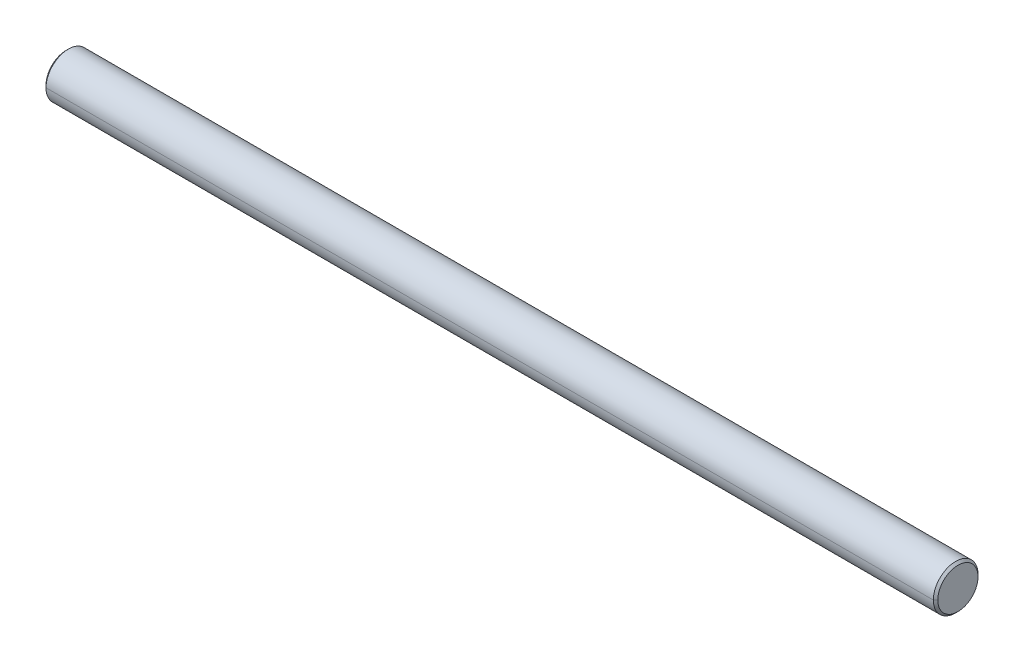
ISO-10303-21;
HEADER;
FILE_DESCRIPTION(('STEP AP214'),'2;1');
FILE_NAME('part.step','',(''),(''),'','','');
FILE_SCHEMA(('AUTOMOTIVE_DESIGN { 1 0 10303 214 1 1 1 1 }'));
ENDSEC;
DATA;
#1=APPLICATION_CONTEXT('core data for automotive mechanical design processes');
#2=APPLICATION_PROTOCOL_DEFINITION('international standard','automotive_design',2000,#1);
#3=PRODUCT_CONTEXT('',#1,'mechanical');
#4=PRODUCT('Part','Part','',(#3));
#5=PRODUCT_RELATED_PRODUCT_CATEGORY('part','',(#4));
#6=PRODUCT_DEFINITION_FORMATION('','',#4);
#7=PRODUCT_DEFINITION_CONTEXT('part definition',#1,'design');
#8=PRODUCT_DEFINITION('design','',#6,#7);
#9=PRODUCT_DEFINITION_SHAPE('','',#8);
#10=(LENGTH_UNIT() NAMED_UNIT(*) SI_UNIT(.MILLI.,.METRE.));
#11=(NAMED_UNIT(*) PLANE_ANGLE_UNIT() SI_UNIT($,.RADIAN.));
#12=(NAMED_UNIT(*) SI_UNIT($,.STERADIAN.) SOLID_ANGLE_UNIT());
#13=UNCERTAINTY_MEASURE_WITH_UNIT(LENGTH_MEASURE(1.E-05),#10,'distance_accuracy_value','');
#14=(GEOMETRIC_REPRESENTATION_CONTEXT(3) GLOBAL_UNCERTAINTY_ASSIGNED_CONTEXT((#13)) GLOBAL_UNIT_ASSIGNED_CONTEXT((#10,
#11,#12)) REPRESENTATION_CONTEXT('',''));
#15=CARTESIAN_POINT('',(0.,0.,0.));
#16=DIRECTION('',(0.,0.,1.));
#17=DIRECTION('',(1.,0.,0.));
#18=AXIS2_PLACEMENT_3D('',#15,#16,#17);
#19=CARTESIAN_POINT('',(489.,0.,0.));
#20=DIRECTION('',(1.,0.,0.));
#21=DIRECTION('',(0.,1.,0.));
#22=AXIS2_PLACEMENT_3D('',#19,#20,#21);
#23=CYLINDRICAL_SURFACE('',#22,12.5);
#24=DIRECTION('',(1.,0.,0.));
#25=VECTOR('',#24,1.);
#26=CARTESIAN_POINT('',(1.25,0.,12.5));
#27=LINE('',#26,#25);
#28=CARTESIAN_POINT('',(1.25,0.,12.5));
#29=VERTEX_POINT('',#28);
#30=CARTESIAN_POINT('',(497.75,0.,12.5));
#31=VERTEX_POINT('',#30);
#32=EDGE_CURVE('E11',#29,#31,#27,.T.);
#33=ORIENTED_EDGE('',*,*,#32,.F.);
#34=CARTESIAN_POINT('',(1.25,0.,0.));
#35=DIRECTION('',(1.,0.,0.));
#36=DIRECTION('',(0.,0.,-1.));
#37=AXIS2_PLACEMENT_3D('',#34,#35,#36);
#38=CIRCLE('',#37,12.5);
#39=CARTESIAN_POINT('',(1.25,0.,-12.5));
#40=VERTEX_POINT('',#39);
#41=EDGE_CURVE('E25',#29,#40,#38,.T.);
#42=ORIENTED_EDGE('',*,*,#41,.T.);
#43=DIRECTION('',(1.,0.,0.));
#44=VECTOR('',#43,1.);
#45=CARTESIAN_POINT('',(1.25,0.,-12.5));
#46=LINE('',#45,#44);
#47=CARTESIAN_POINT('',(497.75,0.,-12.5));
#48=VERTEX_POINT('',#47);
#49=EDGE_CURVE('E108',#40,#48,#46,.T.);
#50=ORIENTED_EDGE('',*,*,#49,.T.);
#51=CARTESIAN_POINT('',(497.75,0.,0.));
#52=DIRECTION('',(1.,0.,0.));
#53=DIRECTION('',(0.,0.,-1.));
#54=AXIS2_PLACEMENT_3D('',#51,#52,#53);
#55=CIRCLE('',#54,12.5);
#56=EDGE_CURVE('E103',#31,#48,#55,.T.);
#57=ORIENTED_EDGE('',*,*,#56,.F.);
#58=EDGE_LOOP('',(#33,#42,#50,#57));
#59=FACE_BOUND('',#58,.T.);
#60=ADVANCED_FACE('F17',(#59),#23,.T.);
#61=CARTESIAN_POINT('',(497.75,0.,0.));
#62=DIRECTION('',(-1.,0.,0.));
#63=DIRECTION('',(0.,1.,0.));
#64=AXIS2_PLACEMENT_3D('',#61,#62,#63);
#65=CONICAL_SURFACE('',#64,12.5,0.785398163397459);
#66=DIRECTION('',(-0.707106781186543,0.,-0.707106781186552));
#67=VECTOR('',#66,1.);
#68=CARTESIAN_POINT('',(499.,0.,-11.25));
#69=LINE('',#68,#67);
#70=CARTESIAN_POINT('',(499.,0.,-11.25));
#71=VERTEX_POINT('',#70);
#72=EDGE_CURVE('E98',#71,#48,#69,.T.);
#73=ORIENTED_EDGE('',*,*,#72,.F.);
#74=CARTESIAN_POINT('',(499.,0.,0.));
#75=DIRECTION('',(1.,0.,0.));
#76=DIRECTION('',(0.,0.,-1.));
#77=AXIS2_PLACEMENT_3D('',#74,#75,#76);
#78=CIRCLE('',#77,11.25);
#79=CARTESIAN_POINT('',(499.,0.,11.25));
#80=VERTEX_POINT('',#79);
#81=EDGE_CURVE('E93',#80,#71,#78,.T.);
#82=ORIENTED_EDGE('',*,*,#81,.F.);
#83=DIRECTION('',(-0.707106781186543,0.,0.707106781186552));
#84=VECTOR('',#83,1.);
#85=CARTESIAN_POINT('',(499.,0.,11.25));
#86=LINE('',#85,#84);
#87=EDGE_CURVE('E88',#80,#31,#86,.T.);
#88=ORIENTED_EDGE('',*,*,#87,.T.);
#89=ORIENTED_EDGE('',*,*,#56,.T.);
#90=EDGE_LOOP('',(#73,#82,#88,#89));
#91=FACE_BOUND('',#90,.T.);
#92=ADVANCED_FACE('F125',(#91),#65,.T.);
#93=CARTESIAN_POINT('',(497.75,0.,0.));
#94=DIRECTION('',(-1.,0.,0.));
#95=DIRECTION('',(0.,-1.,0.));
#96=AXIS2_PLACEMENT_3D('',#93,#94,#95);
#97=CONICAL_SURFACE('',#96,12.5,0.785398163397459);
#98=ORIENTED_EDGE('',*,*,#72,.T.);
#99=CARTESIAN_POINT('',(497.75,0.,0.));
#100=DIRECTION('',(1.,0.,0.));
#101=DIRECTION('',(0.,0.,-1.));
#102=AXIS2_PLACEMENT_3D('',#99,#100,#101);
#103=CIRCLE('',#102,12.5);
#104=EDGE_CURVE('E83',#48,#31,#103,.T.);
#105=ORIENTED_EDGE('',*,*,#104,.T.);
#106=ORIENTED_EDGE('',*,*,#87,.F.);
#107=CARTESIAN_POINT('',(499.,0.,0.));
#108=DIRECTION('',(1.,0.,0.));
#109=DIRECTION('',(0.,0.,-1.));
#110=AXIS2_PLACEMENT_3D('',#107,#108,#109);
#111=CIRCLE('',#110,11.25);
#112=EDGE_CURVE('E71',#71,#80,#111,.T.);
#113=ORIENTED_EDGE('',*,*,#112,.F.);
#114=EDGE_LOOP('',(#98,#105,#106,#113));
#115=FACE_BOUND('',#114,.T.);
#116=ADVANCED_FACE('F123',(#115),#97,.T.);
#117=CARTESIAN_POINT('',(499.,0.,-11.25));
#118=DIRECTION('',(-1.,0.,0.));
#119=DIRECTION('',(0.,0.,1.));
#120=AXIS2_PLACEMENT_3D('',#117,#118,#119);
#121=PLANE('',#120);
#122=ORIENTED_EDGE('',*,*,#112,.T.);
#123=ORIENTED_EDGE('',*,*,#81,.T.);
#124=EDGE_LOOP('',(#122,#123));
#125=FACE_BOUND('',#124,.T.);
#126=ADVANCED_FACE('F127',(#125),#121,.F.);
#127=CARTESIAN_POINT('',(489.,0.,0.));
#128=DIRECTION('',(1.,0.,0.));
#129=DIRECTION('',(0.,-1.,-2.35728675822409E-12));
#130=AXIS2_PLACEMENT_3D('',#127,#128,#129);
#131=CYLINDRICAL_SURFACE('',#130,12.5);
#132=ORIENTED_EDGE('',*,*,#32,.T.);
#133=ORIENTED_EDGE('',*,*,#104,.F.);
#134=ORIENTED_EDGE('',*,*,#49,.F.);
#135=CARTESIAN_POINT('',(1.25,0.,0.));
#136=DIRECTION('',(1.,0.,0.));
#137=DIRECTION('',(0.,0.,-1.));
#138=AXIS2_PLACEMENT_3D('',#135,#136,#137);
#139=CIRCLE('',#138,12.5);
#140=EDGE_CURVE('E69',#40,#29,#139,.T.);
#141=ORIENTED_EDGE('',*,*,#140,.T.);
#142=EDGE_LOOP('',(#132,#133,#134,#141));
#143=FACE_BOUND('',#142,.T.);
#144=ADVANCED_FACE('F119',(#143),#131,.T.);
#145=CARTESIAN_POINT('',(0.,0.,0.));
#146=DIRECTION('',(1.,0.,0.));
#147=DIRECTION('',(0.,-1.,0.));
#148=AXIS2_PLACEMENT_3D('',#145,#146,#147);
#149=CONICAL_SURFACE('',#148,11.25,0.78539816339745);
#150=DIRECTION('',(0.707106781186547,0.,0.707106781186548));
#151=VECTOR('',#150,1.);
#152=CARTESIAN_POINT('',(0.,0.,11.25));
#153=LINE('',#152,#151);
#154=CARTESIAN_POINT('',(0.,0.,11.25));
#155=VERTEX_POINT('',#154);
#156=EDGE_CURVE('E59',#155,#29,#153,.T.);
#157=ORIENTED_EDGE('',*,*,#156,.T.);
#158=ORIENTED_EDGE('',*,*,#140,.F.);
#159=DIRECTION('',(0.707106781186547,0.,-0.707106781186548));
#160=VECTOR('',#159,1.);
#161=CARTESIAN_POINT('',(0.,0.,-11.25));
#162=LINE('',#161,#160);
#163=CARTESIAN_POINT('',(0.,0.,-11.25));
#164=VERTEX_POINT('',#163);
#165=EDGE_CURVE('E60',#164,#40,#162,.T.);
#166=ORIENTED_EDGE('',*,*,#165,.F.);
#167=CARTESIAN_POINT('',(0.,0.,0.));
#168=DIRECTION('',(1.,0.,0.));
#169=DIRECTION('',(0.,0.,-1.));
#170=AXIS2_PLACEMENT_3D('',#167,#168,#169);
#171=CIRCLE('',#170,11.25);
#172=EDGE_CURVE('E54',#164,#155,#171,.T.);
#173=ORIENTED_EDGE('',*,*,#172,.T.);
#174=EDGE_LOOP('',(#157,#158,#166,#173));
#175=FACE_BOUND('',#174,.T.);
#176=ADVANCED_FACE('F56',(#175),#149,.T.);
#177=CARTESIAN_POINT('',(0.,0.,0.));
#178=DIRECTION('',(1.,0.,0.));
#179=DIRECTION('',(0.,0.,-1.));
#180=AXIS2_PLACEMENT_3D('',#177,#178,#179);
#181=PLANE('',#180);
#182=CARTESIAN_POINT('',(0.,0.,0.));
#183=DIRECTION('',(1.,0.,0.));
#184=DIRECTION('',(0.,0.,-1.));
#185=AXIS2_PLACEMENT_3D('',#182,#183,#184);
#186=CIRCLE('',#185,11.25);
#187=EDGE_CURVE('E63',#155,#164,#186,.T.);
#188=ORIENTED_EDGE('',*,*,#187,.F.);
#189=ORIENTED_EDGE('',*,*,#172,.F.);
#190=EDGE_LOOP('',(#188,#189));
#191=FACE_BOUND('',#190,.T.);
#192=ADVANCED_FACE('F65',(#191),#181,.F.);
#193=CARTESIAN_POINT('',(0.,0.,0.));
#194=DIRECTION('',(1.,0.,0.));
#195=DIRECTION('',(0.,1.,0.));
#196=AXIS2_PLACEMENT_3D('',#193,#194,#195);
#197=CONICAL_SURFACE('',#196,11.25,0.78539816339745);
#198=ORIENTED_EDGE('',*,*,#156,.F.);
#199=ORIENTED_EDGE('',*,*,#187,.T.);
#200=ORIENTED_EDGE('',*,*,#165,.T.);
#201=ORIENTED_EDGE('',*,*,#41,.F.);
#202=EDGE_LOOP('',(#198,#199,#200,#201));
#203=FACE_BOUND('',#202,.T.);
#204=ADVANCED_FACE('F68',(#203),#197,.T.);
#205=CLOSED_SHELL('',(#60,#92,#116,#126,#144,#176,#192,#204));
#206=MANIFOLD_SOLID_BREP('B1',#205);
#207=ADVANCED_BREP_SHAPE_REPRESENTATION('',(#18,#206),#14);
#208=SHAPE_DEFINITION_REPRESENTATION(#9,#207);
ENDSEC;
END-ISO-10303-21;
